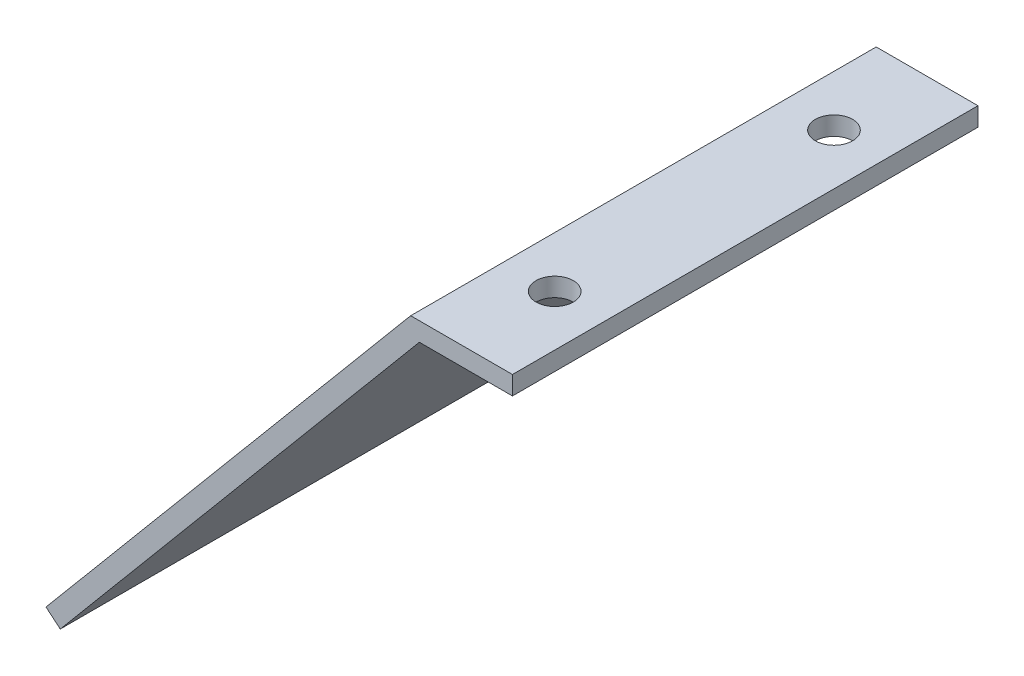
ISO-10303-21;
HEADER;
FILE_DESCRIPTION(('STEP AP214'),'2;1');
FILE_NAME('part.step','',(''),(''),'','','');
FILE_SCHEMA(('AUTOMOTIVE_DESIGN { 1 0 10303 214 1 1 1 1 }'));
ENDSEC;
DATA;
#1=APPLICATION_CONTEXT('core data for automotive mechanical design processes');
#2=APPLICATION_PROTOCOL_DEFINITION('international standard','automotive_design',2000,#1);
#3=PRODUCT_CONTEXT('',#1,'mechanical');
#4=PRODUCT('Part','Part','',(#3));
#5=PRODUCT_RELATED_PRODUCT_CATEGORY('part','',(#4));
#6=PRODUCT_DEFINITION_FORMATION('','',#4);
#7=PRODUCT_DEFINITION_CONTEXT('part definition',#1,'design');
#8=PRODUCT_DEFINITION('design','',#6,#7);
#9=PRODUCT_DEFINITION_SHAPE('','',#8);
#10=(LENGTH_UNIT() NAMED_UNIT(*) SI_UNIT(.MILLI.,.METRE.));
#11=(NAMED_UNIT(*) PLANE_ANGLE_UNIT() SI_UNIT($,.RADIAN.));
#12=(NAMED_UNIT(*) SI_UNIT($,.STERADIAN.) SOLID_ANGLE_UNIT());
#13=UNCERTAINTY_MEASURE_WITH_UNIT(LENGTH_MEASURE(1.E-05),#10,'distance_accuracy_value','');
#14=(GEOMETRIC_REPRESENTATION_CONTEXT(3) GLOBAL_UNCERTAINTY_ASSIGNED_CONTEXT((#13)) GLOBAL_UNIT_ASSIGNED_CONTEXT((#10,
#11,#12)) REPRESENTATION_CONTEXT('',''));
#15=CARTESIAN_POINT('',(0.,0.,0.));
#16=DIRECTION('',(0.,0.,1.));
#17=DIRECTION('',(1.,0.,0.));
#18=AXIS2_PLACEMENT_3D('',#15,#16,#17);
#19=CARTESIAN_POINT('',(0.,2.,50.));
#20=DIRECTION('',(-1.,0.,0.));
#21=DIRECTION('',(0.,0.,1.));
#22=AXIS2_PLACEMENT_3D('',#19,#20,#21);
#23=PLANE('',#22);
#24=DIRECTION('',(0.,1.,0.));
#25=VECTOR('',#24,1.);
#26=CARTESIAN_POINT('',(0.,2.,0.));
#27=LINE('',#26,#25);
#28=CARTESIAN_POINT('',(0.,0.,0.));
#29=VERTEX_POINT('',#28);
#30=CARTESIAN_POINT('',(0.,2.,0.));
#31=VERTEX_POINT('',#30);
#32=EDGE_CURVE('E118',#29,#31,#27,.T.);
#33=ORIENTED_EDGE('',*,*,#32,.T.);
#34=DIRECTION('',(0.,0.,-1.));
#35=VECTOR('',#34,1.);
#36=CARTESIAN_POINT('',(0.,2.,50.));
#37=LINE('',#36,#35);
#38=CARTESIAN_POINT('',(0.,2.,50.));
#39=VERTEX_POINT('',#38);
#40=EDGE_CURVE('E11',#39,#31,#37,.T.);
#41=ORIENTED_EDGE('',*,*,#40,.F.);
#42=DIRECTION('',(0.,1.,0.));
#43=VECTOR('',#42,1.);
#44=CARTESIAN_POINT('',(0.,2.,50.));
#45=LINE('',#44,#43);
#46=CARTESIAN_POINT('',(0.,0.,50.));
#47=VERTEX_POINT('',#46);
#48=EDGE_CURVE('E129',#47,#39,#45,.T.);
#49=ORIENTED_EDGE('',*,*,#48,.F.);
#50=DIRECTION('',(0.,0.,-1.));
#51=VECTOR('',#50,1.);
#52=CARTESIAN_POINT('',(0.,0.,50.));
#53=LINE('',#52,#51);
#54=EDGE_CURVE('E114',#47,#29,#53,.T.);
#55=ORIENTED_EDGE('',*,*,#54,.T.);
#56=EDGE_LOOP('',(#33,#41,#49,#55));
#57=FACE_BOUND('',#56,.T.);
#58=ADVANCED_FACE('F34',(#57),#23,.F.);
#59=CARTESIAN_POINT('',(-10.93261531631,2.,50.));
#60=DIRECTION('',(0.,-1.,0.));
#61=DIRECTION('',(0.,0.,-1.));
#62=AXIS2_PLACEMENT_3D('',#59,#60,#61);
#63=PLANE('',#62);
#64=CARTESIAN_POINT('',(-5.466307658155,2.,10.));
#65=DIRECTION('',(0.,1.,0.));
#66=DIRECTION('',(-1.,0.,0.));
#67=AXIS2_PLACEMENT_3D('',#64,#65,#66);
#68=CIRCLE('',#67,2.);
#69=CARTESIAN_POINT('',(-7.466307658155,2.,10.));
#70=VERTEX_POINT('',#69);
#71=EDGE_CURVE('E226',#70,#70,#68,.T.);
#72=ORIENTED_EDGE('',*,*,#71,.F.);
#73=EDGE_LOOP('',(#72));
#74=FACE_BOUND('',#73,.T.);
#75=CARTESIAN_POINT('',(-5.46630765815499,2.,40.));
#76=DIRECTION('',(0.,1.,0.));
#77=DIRECTION('',(-1.,0.,0.));
#78=AXIS2_PLACEMENT_3D('',#75,#76,#77);
#79=CIRCLE('',#78,2.);
#80=CARTESIAN_POINT('',(-7.466307658155,2.,40.));
#81=VERTEX_POINT('',#80);
#82=EDGE_CURVE('E232',#81,#81,#79,.T.);
#83=ORIENTED_EDGE('',*,*,#82,.F.);
#84=EDGE_LOOP('',(#83));
#85=FACE_BOUND('',#84,.T.);
#86=DIRECTION('',(-1.,0.,0.));
#87=VECTOR('',#86,1.);
#88=CARTESIAN_POINT('',(-10.93261531631,2.,0.));
#89=LINE('',#88,#87);
#90=CARTESIAN_POINT('',(-10.93261531631,2.,0.));
#91=VERTEX_POINT('',#90);
#92=EDGE_CURVE('E121',#31,#91,#89,.T.);
#93=ORIENTED_EDGE('',*,*,#92,.T.);
#94=DIRECTION('',(0.,0.,-1.));
#95=VECTOR('',#94,1.);
#96=CARTESIAN_POINT('',(-10.93261531631,2.,50.));
#97=LINE('',#96,#95);
#98=CARTESIAN_POINT('',(-10.93261531631,2.,50.));
#99=VERTEX_POINT('',#98);
#100=EDGE_CURVE('E42',#99,#91,#97,.T.);
#101=ORIENTED_EDGE('',*,*,#100,.F.);
#102=DIRECTION('',(-1.,0.,0.));
#103=VECTOR('',#102,1.);
#104=CARTESIAN_POINT('',(-10.93261531631,2.,50.));
#105=LINE('',#104,#103);
#106=EDGE_CURVE('E87',#39,#99,#105,.T.);
#107=ORIENTED_EDGE('',*,*,#106,.F.);
#108=ORIENTED_EDGE('',*,*,#40,.T.);
#109=EDGE_LOOP('',(#93,#101,#107,#108));
#110=FACE_BOUND('',#109,.T.);
#111=ADVANCED_FACE('F156',(#74,#85,#110),#63,.F.);
#112=CARTESIAN_POINT('',(-50.0993454674302,-44.6770913677657,50.));
#113=DIRECTION('',(0.76604444311898,-0.642787609686537,0.));
#114=DIRECTION('',(0.642787609686537,0.76604444311898,0.));
#115=AXIS2_PLACEMENT_3D('',#112,#113,#114);
#116=PLANE('',#115);
#117=DIRECTION('',(-0.642787609686537,-0.76604444311898,0.));
#118=VECTOR('',#117,1.);
#119=CARTESIAN_POINT('',(-50.0993454674302,-44.6770913677657,0.));
#120=LINE('',#119,#118);
#121=CARTESIAN_POINT('',(-50.0993454674302,-44.6770913677657,0.));
#122=VERTEX_POINT('',#121);
#123=EDGE_CURVE('E124',#91,#122,#120,.T.);
#124=ORIENTED_EDGE('',*,*,#123,.T.);
#125=DIRECTION('',(0.,0.,-1.));
#126=VECTOR('',#125,1.);
#127=CARTESIAN_POINT('',(-50.0993454674302,-44.6770913677657,50.));
#128=LINE('',#127,#126);
#129=CARTESIAN_POINT('',(-50.0993454674302,-44.6770913677657,50.));
#130=VERTEX_POINT('',#129);
#131=EDGE_CURVE('E109',#130,#122,#128,.T.);
#132=ORIENTED_EDGE('',*,*,#131,.F.);
#133=DIRECTION('',(-0.642787609686537,-0.76604444311898,0.));
#134=VECTOR('',#133,1.);
#135=CARTESIAN_POINT('',(-50.0993454674302,-44.6770913677657,50.));
#136=LINE('',#135,#134);
#137=EDGE_CURVE('E100',#99,#130,#136,.T.);
#138=ORIENTED_EDGE('',*,*,#137,.F.);
#139=ORIENTED_EDGE('',*,*,#100,.T.);
#140=EDGE_LOOP('',(#124,#132,#138,#139));
#141=FACE_BOUND('',#140,.T.);
#142=ADVANCED_FACE('F135',(#141),#116,.F.);
#143=CARTESIAN_POINT('',(-48.5672565811922,-45.9626665871388,50.));
#144=DIRECTION('',(0.64278760968654,0.766044443118977,0.));
#145=DIRECTION('',(-0.766044443118977,0.64278760968654,0.));
#146=AXIS2_PLACEMENT_3D('',#143,#144,#145);
#147=PLANE('',#146);
#148=DIRECTION('',(0.766044443118977,-0.642787609686541,0.));
#149=VECTOR('',#148,1.);
#150=CARTESIAN_POINT('',(-48.5672565811922,-45.9626665871388,0.));
#151=LINE('',#150,#149);
#152=CARTESIAN_POINT('',(-48.5672565811922,-45.9626665871388,0.));
#153=VERTEX_POINT('',#152);
#154=EDGE_CURVE('E108',#122,#153,#151,.T.);
#155=ORIENTED_EDGE('',*,*,#154,.T.);
#156=DIRECTION('',(0.,0.,-1.));
#157=VECTOR('',#156,1.);
#158=CARTESIAN_POINT('',(-48.5672565811922,-45.9626665871388,50.));
#159=LINE('',#158,#157);
#160=CARTESIAN_POINT('',(-48.5672565811922,-45.9626665871388,50.));
#161=VERTEX_POINT('',#160);
#162=EDGE_CURVE('E105',#161,#153,#159,.T.);
#163=ORIENTED_EDGE('',*,*,#162,.F.);
#164=DIRECTION('',(0.766044443118977,-0.642787609686541,0.));
#165=VECTOR('',#164,1.);
#166=CARTESIAN_POINT('',(-48.5672565811922,-45.9626665871388,50.));
#167=LINE('',#166,#165);
#168=EDGE_CURVE('E94',#130,#161,#167,.T.);
#169=ORIENTED_EDGE('',*,*,#168,.F.);
#170=ORIENTED_EDGE('',*,*,#131,.T.);
#171=EDGE_LOOP('',(#155,#163,#169,#170));
#172=FACE_BOUND('',#171,.T.);
#173=ADVANCED_FACE('F106',(#172),#147,.F.);
#174=CARTESIAN_POINT('',(-10.,0.,50.));
#175=DIRECTION('',(-0.76604444311898,0.642787609686537,0.));
#176=DIRECTION('',(-0.642787609686537,-0.76604444311898,0.));
#177=AXIS2_PLACEMENT_3D('',#174,#175,#176);
#178=PLANE('',#177);
#179=DIRECTION('',(0.642787609686537,0.76604444311898,0.));
#180=VECTOR('',#179,1.);
#181=CARTESIAN_POINT('',(-10.,0.,0.));
#182=LINE('',#181,#180);
#183=CARTESIAN_POINT('',(-10.,0.,0.));
#184=VERTEX_POINT('',#183);
#185=EDGE_CURVE('E73',#153,#184,#182,.T.);
#186=ORIENTED_EDGE('',*,*,#185,.T.);
#187=DIRECTION('',(0.,0.,-1.));
#188=VECTOR('',#187,1.);
#189=CARTESIAN_POINT('',(-10.,0.,50.));
#190=LINE('',#189,#188);
#191=CARTESIAN_POINT('',(-10.,0.,50.));
#192=VERTEX_POINT('',#191);
#193=EDGE_CURVE('E110',#192,#184,#190,.T.);
#194=ORIENTED_EDGE('',*,*,#193,.F.);
#195=DIRECTION('',(0.642787609686537,0.76604444311898,0.));
#196=VECTOR('',#195,1.);
#197=CARTESIAN_POINT('',(-10.,0.,50.));
#198=LINE('',#197,#196);
#199=EDGE_CURVE('E98',#161,#192,#198,.T.);
#200=ORIENTED_EDGE('',*,*,#199,.F.);
#201=ORIENTED_EDGE('',*,*,#162,.T.);
#202=EDGE_LOOP('',(#186,#194,#200,#201));
#203=FACE_BOUND('',#202,.T.);
#204=ADVANCED_FACE('F112',(#203),#178,.F.);
#205=CARTESIAN_POINT('',(0.,0.,50.));
#206=DIRECTION('',(0.,1.,0.));
#207=DIRECTION('',(-1.,0.,0.));
#208=AXIS2_PLACEMENT_3D('',#205,#206,#207);
#209=PLANE('',#208);
#210=CARTESIAN_POINT('',(-5.466307658155,0.,10.));
#211=DIRECTION('',(0.,1.,0.));
#212=DIRECTION('',(-1.,0.,0.));
#213=AXIS2_PLACEMENT_3D('',#210,#211,#212);
#214=CIRCLE('',#213,2.);
#215=CARTESIAN_POINT('',(-7.466307658155,0.,10.));
#216=VERTEX_POINT('',#215);
#217=EDGE_CURVE('E122',#216,#216,#214,.F.);
#218=ORIENTED_EDGE('',*,*,#217,.F.);
#219=EDGE_LOOP('',(#218));
#220=FACE_BOUND('',#219,.T.);
#221=CARTESIAN_POINT('',(-5.46630765815499,0.,40.));
#222=DIRECTION('',(0.,1.,0.));
#223=DIRECTION('',(-1.,0.,0.));
#224=AXIS2_PLACEMENT_3D('',#221,#222,#223);
#225=CIRCLE('',#224,2.);
#226=CARTESIAN_POINT('',(-7.466307658155,0.,40.));
#227=VERTEX_POINT('',#226);
#228=EDGE_CURVE('E229',#227,#227,#225,.F.);
#229=ORIENTED_EDGE('',*,*,#228,.F.);
#230=EDGE_LOOP('',(#229));
#231=FACE_BOUND('',#230,.T.);
#232=DIRECTION('',(1.,0.,0.));
#233=VECTOR('',#232,1.);
#234=CARTESIAN_POINT('',(0.,0.,0.));
#235=LINE('',#234,#233);
#236=EDGE_CURVE('E79',#184,#29,#235,.T.);
#237=ORIENTED_EDGE('',*,*,#236,.T.);
#238=ORIENTED_EDGE('',*,*,#54,.F.);
#239=DIRECTION('',(1.,0.,0.));
#240=VECTOR('',#239,1.);
#241=CARTESIAN_POINT('',(0.,0.,50.));
#242=LINE('',#241,#240);
#243=EDGE_CURVE('E50',#192,#47,#242,.T.);
#244=ORIENTED_EDGE('',*,*,#243,.F.);
#245=ORIENTED_EDGE('',*,*,#193,.T.);
#246=EDGE_LOOP('',(#237,#238,#244,#245));
#247=FACE_BOUND('',#246,.T.);
#248=ADVANCED_FACE('F142',(#220,#231,#247),#209,.F.);
#249=CARTESIAN_POINT('',(0.,0.,50.));
#250=DIRECTION('',(0.,0.,-1.));
#251=DIRECTION('',(-1.,0.,0.));
#252=AXIS2_PLACEMENT_3D('',#249,#250,#251);
#253=PLANE('',#252);
#254=ORIENTED_EDGE('',*,*,#48,.T.);
#255=ORIENTED_EDGE('',*,*,#106,.T.);
#256=ORIENTED_EDGE('',*,*,#137,.T.);
#257=ORIENTED_EDGE('',*,*,#168,.T.);
#258=ORIENTED_EDGE('',*,*,#199,.T.);
#259=ORIENTED_EDGE('',*,*,#243,.T.);
#260=EDGE_LOOP('',(#254,#255,#256,#257,#258,#259));
#261=FACE_BOUND('',#260,.T.);
#262=ADVANCED_FACE('F96',(#261),#253,.F.);
#263=CARTESIAN_POINT('',(0.,0.,0.));
#264=DIRECTION('',(0.,0.,-1.));
#265=DIRECTION('',(-1.,0.,0.));
#266=AXIS2_PLACEMENT_3D('',#263,#264,#265);
#267=PLANE('',#266);
#268=ORIENTED_EDGE('',*,*,#32,.F.);
#269=ORIENTED_EDGE('',*,*,#236,.F.);
#270=ORIENTED_EDGE('',*,*,#185,.F.);
#271=ORIENTED_EDGE('',*,*,#154,.F.);
#272=ORIENTED_EDGE('',*,*,#123,.F.);
#273=ORIENTED_EDGE('',*,*,#92,.F.);
#274=EDGE_LOOP('',(#268,#269,#270,#271,#272,#273));
#275=FACE_BOUND('',#274,.T.);
#276=ADVANCED_FACE('F138',(#275),#267,.T.);
#277=CARTESIAN_POINT('',(-5.46630765815501,-45.9636665871388,40.));
#278=DIRECTION('',(0.,1.,0.));
#279=DIRECTION('',(-1.,0.,0.));
#280=AXIS2_PLACEMENT_3D('',#277,#278,#279);
#281=CYLINDRICAL_SURFACE('',#280,2.);
#282=ORIENTED_EDGE('',*,*,#82,.T.);
#283=EDGE_LOOP('',(#282));
#284=FACE_BOUND('',#283,.T.);
#285=ORIENTED_EDGE('',*,*,#228,.T.);
#286=EDGE_LOOP('',(#285));
#287=FACE_BOUND('',#286,.T.);
#288=ADVANCED_FACE('F192',(#284,#287),#281,.F.);
#289=CARTESIAN_POINT('',(-5.46630765815501,-45.9636665871388,10.));
#290=DIRECTION('',(0.,1.,0.));
#291=DIRECTION('',(-1.,0.,0.));
#292=AXIS2_PLACEMENT_3D('',#289,#290,#291);
#293=CYLINDRICAL_SURFACE('',#292,2.);
#294=ORIENTED_EDGE('',*,*,#71,.T.);
#295=EDGE_LOOP('',(#294));
#296=FACE_BOUND('',#295,.T.);
#297=ORIENTED_EDGE('',*,*,#217,.T.);
#298=EDGE_LOOP('',(#297));
#299=FACE_BOUND('',#298,.T.);
#300=ADVANCED_FACE('F210',(#296,#299),#293,.F.);
#301=CLOSED_SHELL('',(#58,#111,#142,#173,#204,#248,#262,#276,#288,#300));
#302=MANIFOLD_SOLID_BREP('B2',#301);
#303=ADVANCED_BREP_SHAPE_REPRESENTATION('',(#18,#302),#14);
#304=SHAPE_DEFINITION_REPRESENTATION(#9,#303);
ENDSEC;
END-ISO-10303-21;
